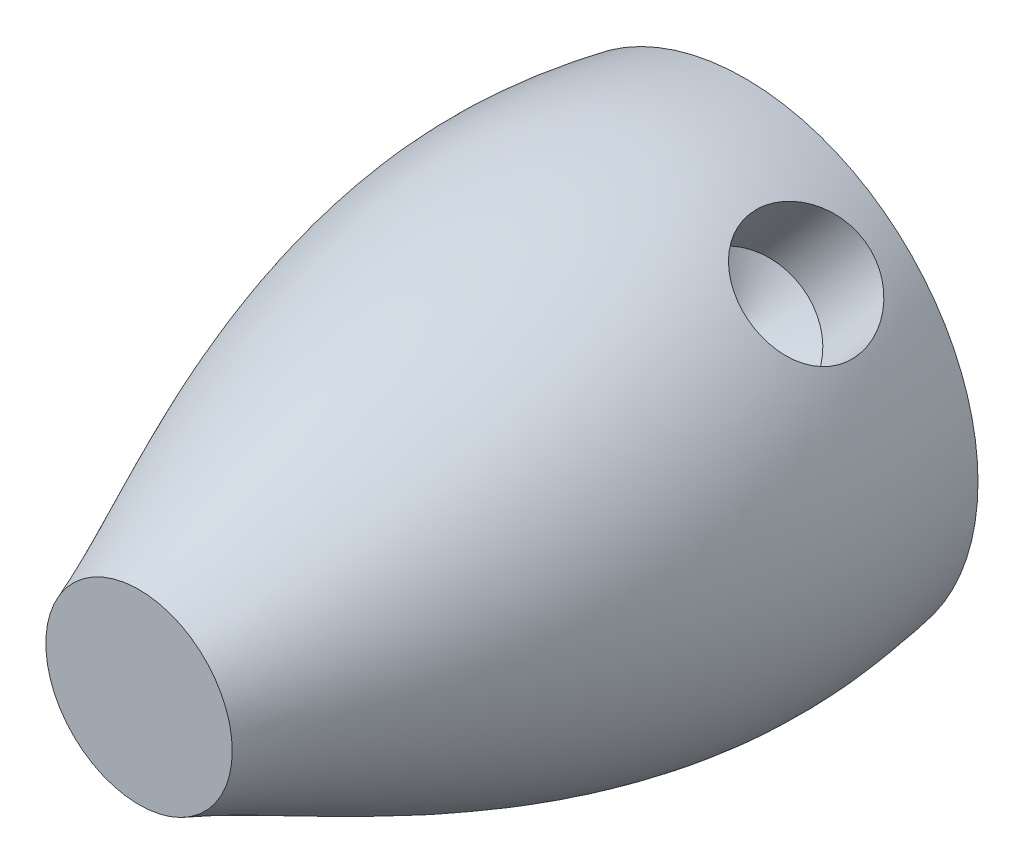
ISO-10303-21;
HEADER;
FILE_DESCRIPTION(('STEP AP214'),'2;1');
FILE_NAME('part.step','',(''),(''),'','','');
FILE_SCHEMA(('AUTOMOTIVE_DESIGN { 1 0 10303 214 1 1 1 1 }'));
ENDSEC;
DATA;
#1=APPLICATION_CONTEXT('core data for automotive mechanical design processes');
#2=APPLICATION_PROTOCOL_DEFINITION('international standard','automotive_design',2000,#1);
#3=PRODUCT_CONTEXT('',#1,'mechanical');
#4=PRODUCT('Part','Part','',(#3));
#5=PRODUCT_RELATED_PRODUCT_CATEGORY('part','',(#4));
#6=PRODUCT_DEFINITION_FORMATION('','',#4);
#7=PRODUCT_DEFINITION_CONTEXT('part definition',#1,'design');
#8=PRODUCT_DEFINITION('design','',#6,#7);
#9=PRODUCT_DEFINITION_SHAPE('','',#8);
#10=(LENGTH_UNIT() NAMED_UNIT(*) SI_UNIT(.MILLI.,.METRE.));
#11=(NAMED_UNIT(*) PLANE_ANGLE_UNIT() SI_UNIT($,.RADIAN.));
#12=(NAMED_UNIT(*) SI_UNIT($,.STERADIAN.) SOLID_ANGLE_UNIT());
#13=UNCERTAINTY_MEASURE_WITH_UNIT(LENGTH_MEASURE(1.E-05),#10,'distance_accuracy_value','');
#14=(GEOMETRIC_REPRESENTATION_CONTEXT(3) GLOBAL_UNCERTAINTY_ASSIGNED_CONTEXT((#13)) GLOBAL_UNIT_ASSIGNED_CONTEXT((#10,
#11,#12)) REPRESENTATION_CONTEXT('',''));
#15=CARTESIAN_POINT('',(0.,0.,0.));
#16=DIRECTION('',(0.,0.,1.));
#17=DIRECTION('',(1.,0.,0.));
#18=AXIS2_PLACEMENT_3D('',#15,#16,#17);
#19=CARTESIAN_POINT('',(0.,0.,130.));
#20=DIRECTION('',(0.,0.,1.));
#21=DIRECTION('',(1.,0.,0.));
#22=AXIS2_PLACEMENT_3D('',#19,#20,#21);
#23=PLANE('',#22);
#24=CARTESIAN_POINT('',(0.,0.,130.));
#25=DIRECTION('',(0.,0.,1.));
#26=DIRECTION('',(1.,0.,0.));
#27=AXIS2_PLACEMENT_3D('',#24,#25,#26);
#28=CIRCLE('',#27,20.);
#29=CARTESIAN_POINT('',(20.,0.,130.));
#30=VERTEX_POINT('',#29);
#31=EDGE_CURVE('E126',#30,#30,#28,.T.);
#32=ORIENTED_EDGE('',*,*,#31,.T.);
#33=EDGE_LOOP('',(#32));
#34=FACE_BOUND('',#33,.T.);
#35=ADVANCED_FACE('F115',(#34),#23,.T.);
#36=CARTESIAN_POINT('',(0.,0.,0.));
#37=DIRECTION('',(0.,0.,1.));
#38=DIRECTION('',(1.,0.,0.));
#39=AXIS2_PLACEMENT_3D('',#36,#37,#38);
#40=PLANE('',#39);
#41=CARTESIAN_POINT('',(0.,0.,0.));
#42=DIRECTION('',(0.,0.,1.));
#43=DIRECTION('',(1.,0.,0.));
#44=AXIS2_PLACEMENT_3D('',#41,#42,#43);
#45=CIRCLE('',#44,50.);
#46=CARTESIAN_POINT('',(50.,0.,0.));
#47=VERTEX_POINT('',#46);
#48=EDGE_CURVE('E12',#47,#47,#45,.T.);
#49=ORIENTED_EDGE('',*,*,#48,.F.);
#50=EDGE_LOOP('',(#49));
#51=FACE_BOUND('',#50,.T.);
#52=ADVANCED_FACE('F161',(#51),#40,.F.);
#53=CARTESIAN_POINT('',(-32.4245990740004,38.061074273992,0.));
#54=CARTESIAN_POINT('',(-39.7337610062467,36.0826723469699,17.7336796616172));
#55=CARTESIAN_POINT('',(-42.574887448827,30.2719696691575,61.8505470971788));
#56=CARTESIAN_POINT('',(-22.3886745179691,23.3392864689636,104.400346328284));
#57=CARTESIAN_POINT('',(-6.40696934158394,18.9459954569825,130.));
#58=CARTESIAN_POINT('',(-34.915690409192,35.9388893556462,0.));
#59=CARTESIAN_POINT('',(-42.0953746073749,33.4821067928256,17.7336746178209));
#60=CARTESIAN_POINT('',(-44.5561684094197,27.4854475152024,61.8505528955075));
#61=CARTESIAN_POINT('',(-23.9162529862577,21.873951223418,104.400341284488));
#62=CARTESIAN_POINT('',(-7.64698176949691,18.5266603195462,130.));
#63=CARTESIAN_POINT('',(-39.4798983935018,31.2040110694551,0.));
#64=CARTESIAN_POINT('',(-46.3064908756612,27.8162090636202,17.7337536975629));
#65=CARTESIAN_POINT('',(-47.9700656533776,21.5224351366232,61.8504619857431));
#66=CARTESIAN_POINT('',(-26.6821933546549,18.6413683274114,104.40042036423));
#67=CARTESIAN_POINT('',(-10.0434642751765,17.4417479611458,130.));
#68=CARTESIAN_POINT('',(-44.8088641908245,22.9021684574213,0.));
#69=CARTESIAN_POINT('',(-50.8430723571909,18.2472388865272,17.7336159572741));
#70=CARTESIAN_POINT('',(-51.2468936611007,11.7500729691864,61.8506203314444));
#71=CARTESIAN_POINT('',(-29.8076568323648,13.0796120029266,104.400282623941));
#72=CARTESIAN_POINT('',(-13.25573764447,15.1507286689896,130.));
#73=CARTESIAN_POINT('',(-48.4158762299049,13.7203946116174,0.));
#74=CARTESIAN_POINT('',(-53.4263457485519,7.97798603635384,17.7337597603891));
#75=CARTESIAN_POINT('',(-52.5547645727148,1.52672259818846,61.8504550159415));
#76=CARTESIAN_POINT('',(-31.7849192035977,7.01181247006658,104.400426427056));
#77=CARTESIAN_POINT('',(-15.953737285751,12.271134118306,130.));
#78=CARTESIAN_POINT('',(-50.1622831730318,4.01127316625011,0.));
#79=CARTESIAN_POINT('',(-53.9558173672894,-2.59846292057489,17.7336108505261));
#80=CARTESIAN_POINT('',(-51.8425397720637,-8.75562710952186,61.850626202142));
#81=CARTESIAN_POINT('',(-32.5439919818202,0.676896038099367,104.400277517193));
#82=CARTESIAN_POINT('',(-18.0445448608339,8.92431164281415,130.));
#83=CARTESIAN_POINT('',(-49.9809971381794,-5.85195881578855,0.));
#84=CARTESIAN_POINT('',(-52.4125503935151,-13.0746507586286,17.7337511046561));
#85=CARTESIAN_POINT('',(-49.1385156850437,-18.7013117712642,61.8504649665391));
#86=CARTESIAN_POINT('',(-32.0487136139519,-5.68560582372743,104.400417771323));
#87=CARTESIAN_POINT('',(-19.4352420315331,5.23160857623305,130.));
#88=CARTESIAN_POINT('',(-47.8789627687394,-15.4903299521931,0.));
#89=CARTESIAN_POINT('',(-48.8542887021106,-23.0486784215386,17.7336192698784));
#90=CARTESIAN_POINT('',(-44.5456386266793,-27.9284296572845,61.8506165232869));
#91=CARTESIAN_POINT('',(-30.3257975015729,-11.8285473769978,104.400285936545));
#92=CARTESIAN_POINT('',(-20.0862259511327,1.339866617386,130.));
#93=CARTESIAN_POINT('',(-43.9369707906802,-24.5334050502527,0.));
#94=CARTESIAN_POINT('',(-43.4194248240795,-32.136827774209,17.7337566795336));
#95=CARTESIAN_POINT('',(-38.2413845077062,-36.0822618204565,61.8504585576816));
#96=CARTESIAN_POINT('',(-27.4333734759028,-17.5172727634819,104.4004233462));
#97=CARTESIAN_POINT('',(-19.9578937729167,-2.60407253490371,130.));
#98=CARTESIAN_POINT('',(-38.3065029821845,-32.6336833398289,0.));
#99=CARTESIAN_POINT('',(-36.3151382625059,-39.9899113385187,17.7336108974263));
#100=CARTESIAN_POINT('',(-30.4670593811155,-42.8493711699221,61.8506261482253));
#101=CARTESIAN_POINT('',(-23.490775565822,-22.5334174533155,104.400277564093));
#102=CARTESIAN_POINT('',(-19.0699589359523,-6.44894251182531,130.));
#103=CARTESIAN_POINT('',(-31.2039383890885,-39.4798629538999,0.));
#104=CARTESIAN_POINT('',(-27.8160866302658,-46.3064456878959,17.7337519987155));
#105=CARTESIAN_POINT('',(-21.5223469307699,-47.9700030194628,61.8504639387319));
#106=CARTESIAN_POINT('',(-18.6415509568627,-26.6821883483058,104.400418665382));
#107=CARTESIAN_POINT('',(-17.4421348793069,-10.043476944568,130.));
#108=CARTESIAN_POINT('',(-22.9022247427725,-44.8088559203641,0.));
#109=CARTESIAN_POINT('',(-18.2473353520005,-50.8430694991112,17.7336154286147));
#110=CARTESIAN_POINT('',(-11.7501485256181,-51.2469009815719,61.8506209391888));
#111=CARTESIAN_POINT('',(-13.0794879359016,-29.8076543121105,104.400282095282));
#112=CARTESIAN_POINT('',(-15.1504536185376,-13.2557331398488,130.));
#113=CARTESIAN_POINT('',(-13.720392233302,-48.4158663605856,0.));
#114=CARTESIAN_POINT('',(-7.97800712046652,-53.4263329108896,17.7337523482674));
#115=CARTESIAN_POINT('',(-1.52673298860978,-52.5547494152617,61.8504635368882));
#116=CARTESIAN_POINT('',(-7.01171041105084,-31.7849342734196,104.400419014934));
#117=CARTESIAN_POINT('',(-12.2709471692017,-15.9537684043844,130.));
#118=CARTESIAN_POINT('',(-4.01129794962579,-50.1622868613357,0.));
#119=CARTESIAN_POINT('',(2.59844823580063,-53.9558182126385,17.733610486588));
#120=CARTESIAN_POINT('',(8.75560795084202,-51.8425468560537,61.8506266205238));
#121=CARTESIAN_POINT('',(-0.676962082498906,-32.5440246431893,104.400277153255));
#122=CARTESIAN_POINT('',(-8.92441342706889,-18.0445965071609,130.));
#123=CARTESIAN_POINT('',(5.85194955661765,-49.9809929821726,0.));
#124=CARTESIAN_POINT('',(13.0746447353639,-52.4125476144091,17.733753653726));
#125=CARTESIAN_POINT('',(18.7013038152891,-49.1385149281417,61.8504620361379));
#126=CARTESIAN_POINT('',(5.68557817234715,-32.0487064377364,104.400420320393));
#127=CARTESIAN_POINT('',(-5.23165028790916,-19.435231217164,130.));
#128=CARTESIAN_POINT('',(15.4902991999435,-47.8789856774689,0.));
#129=CARTESIAN_POINT('',(23.0486345999576,-48.854323567022,17.7336155888641));
#130=CARTESIAN_POINT('',(27.9283970886976,-44.5456712634794,61.8506207549671));
#131=CARTESIAN_POINT('',(11.8285952491746,-30.3257896192209,104.400282255531));
#132=CARTESIAN_POINT('',(-1.33975982623054,-20.0861847557673,130.));
#133=CARTESIAN_POINT('',(24.5334063275149,-43.9369650896233,0.));
#134=CARTESIAN_POINT('',(32.1368198506109,-43.4194107297178,17.7337487910972));
#135=CARTESIAN_POINT('',(36.0822555041074,-38.2413723802444,61.8504676261968));
#136=CARTESIAN_POINT('',(17.5173195545737,-27.4334135661985,104.400415457764));
#137=CARTESIAN_POINT('',(2.60415588345889,-19.9579693443444,130.));
#138=CARTESIAN_POINT('',(32.6336834447721,-38.3065044718282,0.));
#139=CARTESIAN_POINT('',(39.9899116719705,-36.3151196756178,17.7336075202859));
#140=CARTESIAN_POINT('',(42.8493704775999,-30.4670507222133,61.8506300305732));
#141=CARTESIAN_POINT('',(22.5334215746626,-23.4908707479436,104.400274186953));
#142=CARTESIAN_POINT('',(6.44894829881042,-19.0701310803169,130.));
#143=CARTESIAN_POINT('',(39.4798585685666,-31.2039371670258,0.));
#144=CARTESIAN_POINT('',(46.3064415971807,-27.8160759910195,17.7337522712021));
#145=CARTESIAN_POINT('',(47.9699986926018,-21.5223422610379,61.8504636254824));
#146=CARTESIAN_POINT('',(26.6821818031198,-18.64159525374,104.400418937869));
#147=CARTESIAN_POINT('',(10.0434688774753,-17.4422160611067,130.));
#148=CARTESIAN_POINT('',(44.8088813155011,-22.9022006379386,0.));
#149=CARTESIAN_POINT('',(50.8430949705081,-18.2473087068071,17.7336169673254));
#150=CARTESIAN_POINT('',(51.2469219614217,-11.750118935973,61.8506191702931));
#151=CARTESIAN_POINT('',(29.8076598268952,-13.0794595143769,104.400283633992));
#152=CARTESIAN_POINT('',(13.2557286000813,-15.1504268492933,130.));
#153=CARTESIAN_POINT('',(48.4158672978215,-13.7203777971639,0.));
#154=CARTESIAN_POINT('',(53.4263353231463,-7.97798867093445,17.7337543577732));
#155=CARTESIAN_POINT('',(52.5547490768415,-1.52671684480905,61.8504612267681));
#156=CARTESIAN_POINT('',(31.784916089435,-7.01171414446286,104.40042102444));
#157=CARTESIAN_POINT('',(15.9537384472562,-12.2709660074562,130.));
#158=CARTESIAN_POINT('',(50.1622881038629,-4.0112824114822,0.));
#159=CARTESIAN_POINT('',(53.9558214600262,2.59847553005938,17.7336156278501));
#160=CARTESIAN_POINT('',(51.8425481018602,8.75562926727006,61.8506207101487));
#161=CARTESIAN_POINT('',(32.5439993221251,-0.677001235395099,104.400282294517));
#162=CARTESIAN_POINT('',(18.0445548970049,-8.92449755966494,130.));
#163=CARTESIAN_POINT('',(49.9809943509845,5.85196395824451,0.));
#164=CARTESIAN_POINT('',(52.4125466486406,13.0746648663655,17.7337554192477));
#165=CARTESIAN_POINT('',(49.1385130426828,18.7013212974023,61.850460006501));
#166=CARTESIAN_POINT('',(32.0487066995239,5.68556520754067,104.400422085914));
#167=CARTESIAN_POINT('',(19.4352344273327,-5.23168552998891,130.));
#168=CARTESIAN_POINT('',(47.8789644357028,15.4903270341562,0.));
#169=CARTESIAN_POINT('',(48.8542940963731,23.0486616463951,17.7336141452944));
#170=CARTESIAN_POINT('',(44.5456407321263,27.9284196543923,61.8506224144894));
#171=CARTESIAN_POINT('',(30.3257903299984,11.8286121655572,104.400280811961));
#172=CARTESIAN_POINT('',(20.0862087860542,-1.33974718711498,130.));
#173=CARTESIAN_POINT('',(43.9369696134336,24.5334068371467,0.));
#174=CARTESIAN_POINT('',(43.4194217586235,32.1368268182293,17.7337541984789));
#175=CARTESIAN_POINT('',(38.2413815292428,36.0822612213179,61.8504614098919));
#176=CARTESIAN_POINT('',(27.4333818301085,17.5172890602759,104.400420865146));
#177=CARTESIAN_POINT('',(19.9579097209843,2.60410020026995,130.));
#178=CARTESIAN_POINT('',(38.3065041314896,32.6336819907362,0.));
#179=CARTESIAN_POINT('',(36.3151350736566,39.9899202338122,17.7336161257883));
#180=CARTESIAN_POINT('',(30.4670600406858,42.849376540834,61.850620137721));
#181=CARTESIAN_POINT('',(23.4907928238917,22.5333645188568,104.400282792455));
#182=CARTESIAN_POINT('',(19.0699907556361,6.4488484181045,130.));
#183=CARTESIAN_POINT('',(31.2039368119858,39.4798644001526,0.));
#184=CARTESIAN_POINT('',(27.8160884197292,46.3064455990333,17.7337518092563));
#185=CARTESIAN_POINT('',(21.5223463984917,47.9700034655927,61.8504641565333));
#186=CARTESIAN_POINT('',(18.6415341510864,26.6821954999885,104.400418475923));
#187=CARTESIAN_POINT('',(17.4421054135231,10.0434892523273,130.));
#188=CARTESIAN_POINT('',(22.9022273588196,44.8088538108605,0.));
#189=CARTESIAN_POINT('',(18.2473459750714,50.8430566307967,17.7336080665617));
#190=CARTESIAN_POINT('',(11.7501545874918,51.2468914548176,61.8506294025764));
#191=CARTESIAN_POINT('',(13.0794575967164,29.80771307576,104.400274733229));
#192=CARTESIAN_POINT('',(15.1503947744871,13.2558384755373,130.));
#193=CARTESIAN_POINT('',(13.7203875991267,48.4158699295813,0.));
#194=CARTESIAN_POINT('',(7.97799490820335,53.4263420095538,17.7337567820563));
#195=CARTESIAN_POINT('',(1.526724725142,52.5547563977894,61.8504584398216));
#196=CARTESIAN_POINT('',(7.01173641256641,31.7849032898353,104.400423448723));
#197=CARTESIAN_POINT('',(12.2709999183698,15.9537118603338,130.));
#198=CARTESIAN_POINT('',(4.01130629378014,50.162280523947,0.));
#199=CARTESIAN_POINT('',(-2.59845019023331,53.9558278239609,17.7336218285201));
#200=CARTESIAN_POINT('',(-8.75560440830121,51.842554244903,61.8506135818826));
#201=CARTESIAN_POINT('',(0.677024629697223,32.5439359388835,104.400288495187));
#202=CARTESIAN_POINT('',(8.92451828968199,18.0444426577783,130.));
#203=CARTESIAN_POINT('',(-5.8519647379407,49.9810044728384,0.));
#204=CARTESIAN_POINT('',(-13.0746512379501,52.4125451033168,17.7337439858961));
#205=CARTESIAN_POINT('',(-18.701315649965,49.138512737692,61.8504731502379));
#206=CARTESIAN_POINT('',(-5.68564377288501,32.0487847714592,104.400410652563));
#207=CARTESIAN_POINT('',(5.23154733293421,19.4353641189324,130.));
#208=CARTESIAN_POINT('',(-15.4902701497652,47.8789636564027,0.));
#209=CARTESIAN_POINT('',(-23.0485807320767,48.8542771969748,17.7335948494816));
#210=CARTESIAN_POINT('',(-27.9283499318839,44.5456371341806,61.8506445968806));
#211=CARTESIAN_POINT('',(-11.8286759059951,30.325921862301,104.400261516148));
#212=CARTESIAN_POINT('',(1.33958383024193,20.086430117423,130.));
#213=CARTESIAN_POINT('',(-24.5334729619654,43.9370161527661,0.));
#214=CARTESIAN_POINT('',(-32.1369318485056,43.4194979617221,17.7337839603411));
#215=CARTESIAN_POINT('',(-36.0823523337881,38.2414375793252,61.850427195771));
#216=CARTESIAN_POINT('',(-17.5172082735043,27.4332155417985,104.400450627008));
#217=CARTESIAN_POINT('',(-2.60387543627939,19.9575945268767,130.));
#218=CARTESIAN_POINT('',(-29.9335077388088,40.1832591923377,0.));
#219=CARTESIAN_POINT('',(-37.3721474051186,38.6832379011142,17.7336847054136));
#220=CARTESIAN_POINT('',(-40.5936064882343,33.0584918231127,61.8505412988501));
#221=CARTESIAN_POINT('',(-20.8610960496806,24.8046217145093,104.40035137208));
#222=CARTESIAN_POINT('',(-5.16695691367097,19.3653305944189,130.));
#223=CARTESIAN_POINT('',(-32.4245990740004,38.061074273992,0.));
#224=CARTESIAN_POINT('',(-39.7337610062467,36.0826723469699,17.7336796616172));
#225=CARTESIAN_POINT('',(-42.574887448827,30.2719696691575,61.8505470971788));
#226=CARTESIAN_POINT('',(-22.3886745179691,23.3392864689636,104.400346328284));
#227=CARTESIAN_POINT('',(-6.40696934158394,18.9459954569825,130.));
#228=B_SPLINE_SURFACE_WITH_KNOTS('',3,3,((#53,#54,#55,#56,#57),(#58,#59,#60,#61,#62),(#63,#64,
#65,#66,#67),(#68,#69,#70,#71,#72),(#73,#74,#75,#76,#77),(#78,#79,#80,#81,#82),(#83,#84,#85,#86,
#87),(#88,#89,#90,#91,#92),(#93,#94,#95,#96,#97),(#98,#99,#100,#101,#102),(#103,#104,#105,#106,
#107),(#108,#109,#110,#111,#112),(#113,#114,#115,#116,#117),(#118,#119,#120,#121,#122),(#123,
#124,#125,#126,#127),(#128,#129,#130,#131,#132),(#133,#134,#135,#136,#137),(#138,#139,#140,#141,
#142),(#143,#144,#145,#146,#147),(#148,#149,#150,#151,#152),(#153,#154,#155,#156,#157),(#158,
#159,#160,#161,#162),(#163,#164,#165,#166,#167),(#168,#169,#170,#171,#172),(#173,#174,#175,#176,
#177),(#178,#179,#180,#181,#182),(#183,#184,#185,#186,#187),(#188,#189,#190,#191,#192),(#193,
#194,#195,#196,#197),(#198,#199,#200,#201,#202),(#203,#204,#205,#206,#207),(#208,#209,#210,#211,
#212),(#213,#214,#215,#216,#217),(#218,#219,#220,#221,#222),(#223,#224,#225,#226,#227)),
.UNSPECIFIED.,.T.,.F.,.F.,(4,1,1,1,1,1,1,1,1,1,1,1,1,1,1,1,1,1,1,1,1,1,1,1,1,1,1,1,1,1,1,1,4),
(4,1,4),(0.,0.03125,0.0625,0.09375,0.125,0.15625,0.1875,0.21875,0.25,0.28125,0.3125,0.34375,
0.375,0.40625,0.4375,0.46875,0.5,0.53125,0.5625,0.59375,0.625,0.65625,0.6875,0.71875,0.75,
0.78125,0.8125,0.84375,0.875,0.90625,0.9375,0.96875,1.),(0.,0.368097893073782,1.),.UNSPECIFIED.);
#229=CARTESIAN_POINT('',(22.7538891701182,47.1466239160192,20.3051574954534));
#230=CARTESIAN_POINT('',(22.7640282674121,47.1584181084151,20.681865919907));
#231=CARTESIAN_POINT('',(22.7877432354157,47.1617502222285,21.0584002284696));
#232=CARTESIAN_POINT('',(22.8620781559466,47.1514163793845,21.8086862571438));
#233=CARTESIAN_POINT('',(22.9127037276154,47.1377468718586,22.1824373795711));
#234=CARTESIAN_POINT('',(23.0404221605987,47.0933505498167,22.9246929831731));
#235=CARTESIAN_POINT('',(23.1175384373587,47.0626086299204,23.2931925212729));
#236=CARTESIAN_POINT('',(23.2974640768495,46.9840890559379,24.0219934200316));
#237=CARTESIAN_POINT('',(23.4002721221434,46.9363122753213,24.3822952000265));
#238=CARTESIAN_POINT('',(23.6305007993424,46.8238556386327,25.0919234135325));
#239=CARTESIAN_POINT('',(23.7579024932484,46.7591887750959,25.4412580530315));
#240=CARTESIAN_POINT('',(24.0361646079609,46.6130865388624,26.1268347331546));
#241=CARTESIAN_POINT('',(24.1870253060527,46.5316509679559,26.4630766189638));
#242=CARTESIAN_POINT('',(24.5107827415444,46.3522436577775,27.120117737975));
#243=CARTESIAN_POINT('',(24.683676083461,46.2542744657737,27.4409193402291));
#244=CARTESIAN_POINT('',(25.0499526720263,46.0420788683445,28.0649667933264));
#245=CARTESIAN_POINT('',(25.2433359828188,45.9278524120254,28.3682125892066));
#246=CARTESIAN_POINT('',(25.6503633195426,45.6826127307775,28.9572534916493));
#247=CARTESIAN_POINT('',(25.8641449377862,45.5514830543446,29.2429050551265));
#248=CARTESIAN_POINT('',(26.3088832591473,45.2735520218918,29.7923813954635));
#249=CARTESIAN_POINT('',(26.5398400528321,45.1267505832306,30.0562060572113));
#250=CARTESIAN_POINT('',(27.0169605967288,44.8180363058367,30.5602363175288));
#251=CARTESIAN_POINT('',(27.2631251480556,44.6561226707932,30.8004406700967));
#252=CARTESIAN_POINT('',(27.7685769523105,44.3178713796898,31.2555571654417));
#253=CARTESIAN_POINT('',(28.0278642186709,44.1415337088655,31.4704692823292));
#254=CARTESIAN_POINT('',(28.5586174284113,43.7744028780795,31.8744180868521));
#255=CARTESIAN_POINT('',(28.8301334164745,43.5835475967997,32.0633325932076));
#256=CARTESIAN_POINT('',(29.3819978807748,43.1890396236288,32.4127724553697));
#257=CARTESIAN_POINT('',(29.6623463928327,42.9853868798332,32.5732976960245));
#258=CARTESIAN_POINT('',(30.2295787319422,42.5663855713981,32.8647843852787));
#259=CARTESIAN_POINT('',(30.5164622950938,42.3510374785584,32.99574702536));
#260=CARTESIAN_POINT('',(31.0944663289077,41.9098805545257,33.2271467622661));
#261=CARTESIAN_POINT('',(31.3855867662064,41.6840718056752,33.3275840993281));
#262=CARTESIAN_POINT('',(31.9675772864135,41.2251037567712,33.4965470515912));
#263=CARTESIAN_POINT('',(32.2584330424883,40.992011840531,33.5653050879041));
#264=CARTESIAN_POINT('',(32.8398136472601,40.5183969998132,33.6714924161622));
#265=CARTESIAN_POINT('',(33.1303384975283,40.2778741107764,33.7089218575005));
#266=CARTESIAN_POINT('',(33.7088586667635,39.7910430407311,33.752168813387));
#267=CARTESIAN_POINT('',(33.9968541101573,39.5447351465141,33.7579878917106));
#268=CARTESIAN_POINT('',(34.568232557263,39.0480898525315,33.7379741856344));
#269=CARTESIAN_POINT('',(34.8516155798601,38.7977524692729,33.7121415308641));
#270=CARTESIAN_POINT('',(35.4095468412351,38.296942787331,33.6293525236553));
#271=CARTESIAN_POINT('',(35.6841475728887,38.0464875425723,33.5726464559086));
#272=CARTESIAN_POINT('',(36.2250335969998,37.5453778244884,33.4286993034442));
#273=CARTESIAN_POINT('',(36.4913189407812,37.2947233524026,33.3414584072326));
#274=CARTESIAN_POINT('',(37.0138846916073,36.7951737526206,33.1370783805607));
#275=CARTESIAN_POINT('',(37.2701649137316,36.5462786575117,33.0199386977954));
#276=CARTESIAN_POINT('',(37.771158583289,36.0522451740085,32.7566071339468));
#277=CARTESIAN_POINT('',(38.0158719653327,35.8071068068569,32.6104150886497));
#278=CARTESIAN_POINT('',(38.4932205895907,35.3216693860093,32.2894081767002));
#279=CARTESIAN_POINT('',(38.7258064137119,35.0813922554921,32.1144866790123));
#280=CARTESIAN_POINT('',(39.1766068281401,34.6086564807406,31.7376476964034));
#281=CARTESIAN_POINT('',(39.3948213957699,34.3761978488439,31.5357301688853));
#282=CARTESIAN_POINT('',(39.8157423590335,33.9210706843099,31.1062858329975));
#283=CARTESIAN_POINT('',(40.0184479230219,33.698402676951,30.8787576529123));
#284=CARTESIAN_POINT('',(40.4073233204732,33.2648056904052,30.39965464712));
#285=CARTESIAN_POINT('',(40.5934930414087,33.0538767911074,30.1480796577971));
#286=CARTESIAN_POINT('',(40.9501284751531,32.6436485220885,29.6200329220422));
#287=CARTESIAN_POINT('',(41.1204242982167,32.4444818410458,29.3433433020004));
#288=CARTESIAN_POINT('',(41.4424523287784,32.0618666543319,28.7690786140905));
#289=CARTESIAN_POINT('',(41.5941844087324,31.8784182566572,28.471503402748));
#290=CARTESIAN_POINT('',(41.8784026068234,31.5289755538139,27.8575024067672));
#291=CARTESIAN_POINT('',(42.0108884821602,31.3629814688471,27.5410763843879));
#292=CARTESIAN_POINT('',(42.2560343363723,31.0500625958881,26.8915533723446));
#293=CARTESIAN_POINT('',(42.3686943628438,30.9031377621163,26.5584564227053));
#294=CARTESIAN_POINT('',(42.5738102466745,30.6296839874644,25.8775675172941));
#295=CARTESIAN_POINT('',(42.6662463634316,30.5031750058606,25.5297615956315));
#296=CARTESIAN_POINT('',(42.8303934945526,30.2720142987044,24.8221973834539));
#297=CARTESIAN_POINT('',(42.9021044713811,30.167362612738,24.4624390712931));
#298=CARTESIAN_POINT('',(43.0245137097506,29.9810100996161,23.7335461564897));
#299=CARTESIAN_POINT('',(43.0752131666158,29.8993079669689,23.3644120884927));
#300=CARTESIAN_POINT('',(43.1554198015254,29.7597108139584,22.6194017564276));
#301=CARTESIAN_POINT('',(43.1849271659016,29.7018155842745,22.2435255516696));
#302=CARTESIAN_POINT('',(43.2224833668308,29.6108895218193,21.491400827245));
#303=CARTESIAN_POINT('',(43.23073618451,29.5776245321615,21.1151907767764));
#304=CARTESIAN_POINT('',(43.2263875648362,29.5353967271896,20.3615301755006));
#305=CARTESIAN_POINT('',(43.2137862609996,29.5264337562852,19.9840796326509));
#306=CARTESIAN_POINT('',(43.1678397170764,29.5328945015193,19.2306668627746));
#307=CARTESIAN_POINT('',(43.1344952089913,29.5483173571422,18.8547045837001));
#308=CARTESIAN_POINT('',(43.0472648617326,29.6033677746529,18.1069594945978));
#309=CARTESIAN_POINT('',(42.9933790539737,29.6429952995234,17.7351766781791));
#310=CARTESIAN_POINT('',(42.8657208329585,29.7457197829887,17.0005507409915));
#311=CARTESIAN_POINT('',(42.7920631927611,29.8086820649412,16.6376688192666));
#312=CARTESIAN_POINT('',(42.6250946320388,29.957419926737,15.9212252967422));
#313=CARTESIAN_POINT('',(42.5317838076377,30.0431953950015,15.5676636503666));
#314=CARTESIAN_POINT('',(42.325953516516,30.2366608345267,14.8723115525717));
#315=CARTESIAN_POINT('',(42.2134333507057,30.3443516033831,14.5305215301038));
#316=CARTESIAN_POINT('',(41.9697103455302,30.5805385187446,13.8610841295464));
#317=CARTESIAN_POINT('',(41.8385073593104,30.7090348287906,13.5334368626509));
#318=CARTESIAN_POINT('',(41.5569875876978,30.9865574029994,12.8921854559009));
#319=CARTESIAN_POINT('',(41.4065377053196,31.1357272935665,12.5787019025953));
#320=CARTESIAN_POINT('',(41.0879741166109,31.4523876552424,11.9705273532608));
#321=CARTESIAN_POINT('',(40.919860336024,31.6198782033687,11.6758364362417));
#322=CARTESIAN_POINT('',(40.5667251980198,31.9715664001177,11.107260071652));
#323=CARTESIAN_POINT('',(40.381702825884,32.1557650514223,10.833375874543));
#324=CARTESIAN_POINT('',(39.9956117958943,32.5391165189232,10.308323673613));
#325=CARTESIAN_POINT('',(39.7945430502634,32.738269416922,10.0571557940712));
#326=CARTESIAN_POINT('',(39.3753420472048,33.1516223446864,9.57703526670739));
#327=CARTESIAN_POINT('',(39.1570669914214,33.3659463631017,9.34831397559879));
#328=CARTESIAN_POINT('',(38.7062174200515,33.8059702767201,8.91744490059169));
#329=CARTESIAN_POINT('',(38.4736428021386,34.0316702533265,8.71529730688471));
#330=CARTESIAN_POINT('',(37.9954102492234,34.4923941560895,8.33906098103223));
#331=CARTESIAN_POINT('',(37.7497525970759,34.727417880639,8.16497164259579));
#332=CARTESIAN_POINT('',(37.2466930159716,35.2046983463764,7.84614976897358));
#333=CARTESIAN_POINT('',(36.9892911661489,35.4469550388236,7.70141703601459));
#334=CARTESIAN_POINT('',(36.4652151797466,35.9357084041976,7.44288919779528));
#335=CARTESIAN_POINT('',(36.19857856976,36.1821862370832,7.32898241952067));
#336=CARTESIAN_POINT('',(35.6567977407218,36.678193889991,7.13228836318843));
#337=CARTESIAN_POINT('',(35.3816535311655,36.9277237066068,7.0495010504005));
#338=CARTESIAN_POINT('',(34.8246726387371,37.4277955217039,6.915702152313));
#339=CARTESIAN_POINT('',(34.5428363971399,37.6783374525469,6.86468847785618));
#340=CARTESIAN_POINT('',(33.9743872458269,38.1784844975308,6.79483545649671));
#341=CARTESIAN_POINT('',(33.6877743781791,38.4280896198985,6.7759958263869));
#342=CARTESIAN_POINT('',(33.1151457862243,38.9216190352321,6.77067178349659));
#343=CARTESIAN_POINT('',(32.829161292022,39.1655756452731,6.7838167527535));
#344=CARTESIAN_POINT('',(32.2566031005535,39.6490252306823,6.84158598537182));
#345=CARTESIAN_POINT('',(31.9700294080933,39.8885182423017,6.88620999296206));
#346=CARTESIAN_POINT('',(31.3984363582294,40.3614513321599,7.00658870004337));
#347=CARTESIAN_POINT('',(31.1134169897538,40.5948914535593,7.08234317749096));
#348=CARTESIAN_POINT('',(30.5471152348347,41.0542707510363,7.26439870019393));
#349=CARTESIAN_POINT('',(30.2658328595026,41.2802099048136,7.37069983625449));
#350=CARTESIAN_POINT('',(29.7094675708523,41.7230715879011,7.612928356043));
#351=CARTESIAN_POINT('',(29.4343791150305,41.9400023379804,7.74882798881942));
#352=CARTESIAN_POINT('',(28.8923257707422,42.3639212502276,8.04930081796276));
#353=CARTESIAN_POINT('',(28.6253608693173,42.5709094282561,8.21387396858733));
#354=CARTESIAN_POINT('',(28.1017129304774,42.9739447277145,8.57050265003002));
#355=CARTESIAN_POINT('',(27.8450302236866,43.169991497403,8.76255906366633));
#356=CARTESIAN_POINT('',(27.3440664657154,43.5502550217478,9.1727828631046));
#357=CARTESIAN_POINT('',(27.0997855194104,43.7344716763663,9.39095046966324));
#358=CARTESIAN_POINT('',(26.6230396307941,44.0922758786574,9.85442633447781));
#359=CARTESIAN_POINT('',(26.3907355630479,44.2657230711635,10.100008480567));
#360=CARTESIAN_POINT('',(25.9429112655455,44.5990402028718,10.6145778664454));
#361=CARTESIAN_POINT('',(25.7273912087714,44.758910002142,10.8835653473983));
#362=CARTESIAN_POINT('',(25.3149980224167,45.0644979562672,11.4431331906069));
#363=CARTESIAN_POINT('',(25.1181292587379,45.2102127979257,11.7337185802419));
#364=CARTESIAN_POINT('',(24.7448814675723,45.486909719172,12.3344027404324));
#365=CARTESIAN_POINT('',(24.5685022011577,45.6178919705557,12.6445012833804));
#366=CARTESIAN_POINT('',(24.2368773956499,45.8653875579363,13.2839637995715));
#367=CARTESIAN_POINT('',(24.0817642706156,45.9818098741987,13.6134317080465));
#368=CARTESIAN_POINT('',(23.7954141294745,46.1988353353958,14.2876003240792));
#369=CARTESIAN_POINT('',(23.6641770902117,46.2994384956724,14.6323010168633));
#370=CARTESIAN_POINT('',(23.4269751712614,46.4843612115648,15.3341677218742));
#371=CARTESIAN_POINT('',(23.320987300053,46.5686955678965,15.6913220515809));
#372=CARTESIAN_POINT('',(23.1352132098609,46.7208375200967,16.4156941831278));
#373=CARTESIAN_POINT('',(23.0554211541775,46.7886487966098,16.7829097234428));
#374=CARTESIAN_POINT('',(22.8969883585558,46.9306436151015,17.6694880208429));
#375=CARTESIAN_POINT('',(22.8308958631602,46.9970254990792,18.1924133170663));
#376=CARTESIAN_POINT('',(22.7522180560107,47.0967232053492,19.2453930615324));
#377=CARTESIAN_POINT('',(22.7396320373074,47.1300394645136,19.7754474154903));
#378=CARTESIAN_POINT('',(22.7538891701182,47.1466239160192,20.3051574954534));
#379=B_SPLINE_CURVE_WITH_KNOTS('',3,(#229,#230,#231,#232,#233,#234,#235,#236,#237,#238,#239,
#240,#241,#242,#243,#244,#245,#246,#247,#248,#249,#250,#251,#252,#253,#254,#255,#256,#257,#258,
#259,#260,#261,#262,#263,#264,#265,#266,#267,#268,#269,#270,#271,#272,#273,#274,#275,#276,#277,
#278,#279,#280,#281,#282,#283,#284,#285,#286,#287,#288,#289,#290,#291,#292,#293,#294,#295,#296,
#297,#298,#299,#300,#301,#302,#303,#304,#305,#306,#307,#308,#309,#310,#311,#312,#313,#314,#315,
#316,#317,#318,#319,#320,#321,#322,#323,#324,#325,#326,#327,#328,#329,#330,#331,#332,#333,#334,
#335,#336,#337,#338,#339,#340,#341,#342,#343,#344,#345,#346,#347,#348,#349,#350,#351,#352,#353,
#354,#355,#356,#357,#358,#359,#360,#361,#362,#363,#364,#365,#366,#367,#368,#369,#370,#371,#372,
#373,#374,#375,#376,#377,#378),.UNSPECIFIED.,.T.,.F.,(4,2,2,2,2,2,2,2,2,2,2,2,2,2,2,2,2,2,2,2,2,
2,2,2,2,2,2,2,2,2,2,2,2,2,2,2,2,2,2,2,2,2,2,2,2,2,2,2,2,2,2,2,2,2,2,2,2,2,2,2,2,2,2,2,2,2,2,2,2,
2,2,2,2,2,4),(0.,1.13062314108319,2.26148245778198,3.39334393738257,4.52514738866026,
5.65608276203155,6.78703150406768,7.91780616421622,9.04858436436052,10.1876168879522,
11.3266554182592,12.4657540021285,13.6048537519941,14.7491363590101,15.8934236073348,
17.0376647284245,18.1818968439857,19.3175949004988,20.4532875412994,21.5889239984887,
22.7245558047044,23.8511154544504,24.9776681495272,26.1042416563421,27.23082153112,
28.3616813991148,29.4925430515152,30.6234653021125,31.7543952481153,32.8962977999513,
34.0382081969035,35.1801329983533,36.3220550583306,37.4650868267022,38.6081206652093,
39.7510894687389,40.8940482225701,42.0259963483922,43.1579372270582,44.2898381632219,
45.4217373683262,46.5472030428664,47.6726632128807,48.7981643507416,49.9236743359746,
51.0574370743532,52.1912045790945,53.3250401682322,54.4588819601133,55.60339618882,
56.7479186085226,57.8924162937347,59.0369062682969,60.1771928496616,61.3174781584268,
62.4576884840615,63.5978887731159,64.724940164467,65.8519823984881,66.9790165938248,
68.106054139499,69.2320395118791,70.3580230880108,71.484042841142,72.6100721148625,
73.7485754236185,74.8870904646582,76.025871354648,77.1646389639992,78.3102030260757,
79.4557659771398,80.6002817737511,81.7445423870106,83.3343937114434,84.9242240300515),.UNSPECIFIED.);
#380=CARTESIAN_POINT('',(22.7538891701182,47.1466239160192,20.3051574954534));
#381=VERTEX_POINT('',#380);
#382=EDGE_CURVE('E119',#381,#381,#379,.T.);
#383=ORIENTED_EDGE('',*,*,#382,.F.);
#384=EDGE_LOOP('',(#383));
#385=FACE_BOUND('',#384,.T.);
#386=ORIENTED_EDGE('',*,*,#48,.T.);
#387=EDGE_LOOP('',(#386));
#388=FACE_BOUND('',#387,.T.);
#389=ORIENTED_EDGE('',*,*,#31,.F.);
#390=EDGE_LOOP('',(#389));
#391=FACE_BOUND('',#390,.T.);
#392=ADVANCED_FACE('F134',(#385,#388,#391),#228,.T.);
#393=CARTESIAN_POINT('',(21.1081643639611,24.5328529770326,21.0426359347215));
#394=DIRECTION('',(0.651617758932493,0.757468162562361,-0.0404509449604924));
#395=DIRECTION('',(-0.758088638724502,0.652151528279151,0.));
#396=AXIS2_PLACEMENT_3D('',#393,#394,#395);
#397=CONICAL_SURFACE('',#396,13.5,1.02974425867665);
#398=CARTESIAN_POINT('',(15.8224897889404,18.3885603248456,21.3707585624159));
#399=VERTEX_POINT('',#398);
#400=VERTEX_LOOP('',#399);
#401=FACE_BOUND('',#400,.T.);
#402=CARTESIAN_POINT('',(21.1081643639611,24.5328529770326,21.0426359347215));
#403=DIRECTION('',(0.651617758932493,0.757468162562361,-0.0404509449604924));
#404=DIRECTION('',(-0.758088638724502,0.652151528279151,0.));
#405=AXIS2_PLACEMENT_3D('',#402,#403,#404);
#406=CIRCLE('',#405,13.5);
#407=CARTESIAN_POINT('',(10.8739677411803,33.3368986088012,21.0426359347215));
#408=VERTEX_POINT('',#407);
#409=EDGE_CURVE('E138',#408,#408,#406,.T.);
#410=ORIENTED_EDGE('',*,*,#409,.T.);
#411=EDGE_LOOP('',(#410));
#412=FACE_BOUND('',#411,.T.);
#413=ADVANCED_FACE('F130',(#401,#412),#397,.F.);
#414=CARTESIAN_POINT('',(34.1405195426109,39.6822162282798,20.2336170355117));
#415=DIRECTION('',(0.651617758932493,0.757468162562361,-0.0404509449604924));
#416=DIRECTION('',(-0.758088638724502,0.652151528279151,0.));
#417=AXIS2_PLACEMENT_3D('',#414,#415,#416);
#418=CYLINDRICAL_SURFACE('',#417,13.5);
#419=ORIENTED_EDGE('',*,*,#382,.T.);
#420=EDGE_LOOP('',(#419));
#421=FACE_BOUND('',#420,.T.);
#422=ORIENTED_EDGE('',*,*,#409,.F.);
#423=EDGE_LOOP('',(#422));
#424=FACE_BOUND('',#423,.T.);
#425=ADVANCED_FACE('F133',(#421,#424),#418,.F.);
#426=CLOSED_SHELL('',(#35,#52,#392,#413,#425));
#427=MANIFOLD_SOLID_BREP('B2',#426);
#428=ADVANCED_BREP_SHAPE_REPRESENTATION('',(#18,#427),#14);
#429=SHAPE_DEFINITION_REPRESENTATION(#9,#428);
ENDSEC;
END-ISO-10303-21;
